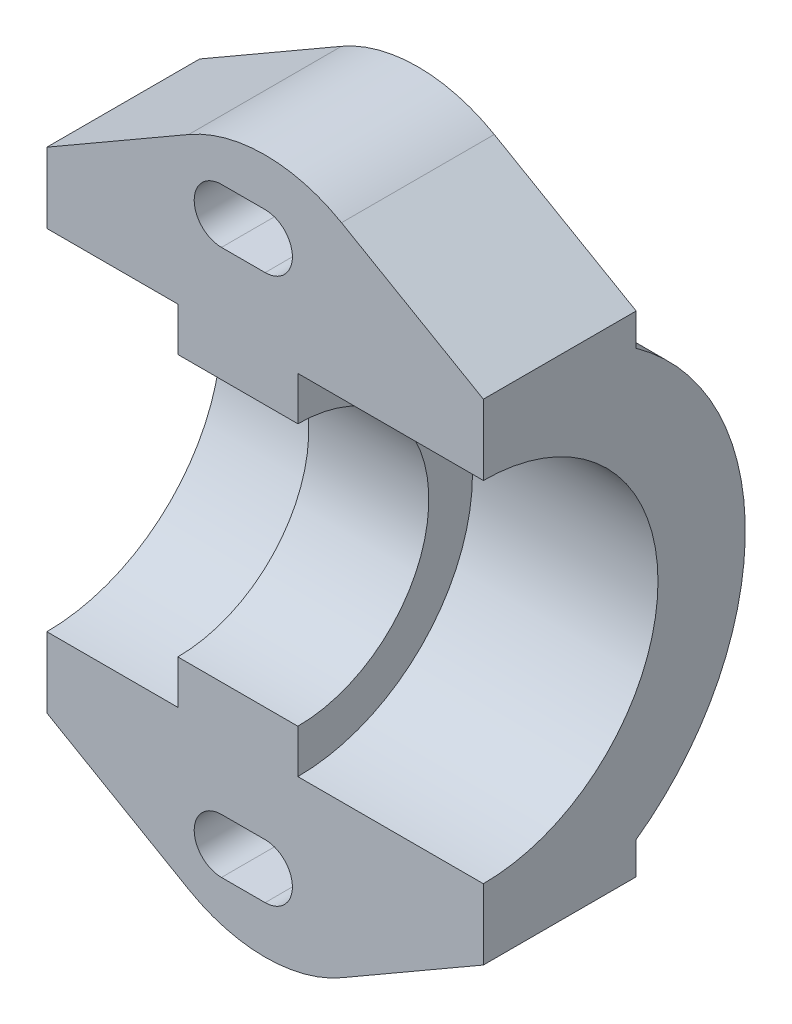
ISO-10303-21;
HEADER;
FILE_DESCRIPTION(('STEP AP214'),'2;1');
FILE_NAME('part.step','',(''),(''),'','','');
FILE_SCHEMA(('AUTOMOTIVE_DESIGN { 1 0 10303 214 1 1 1 1 }'));
ENDSEC;
DATA;
#1=APPLICATION_CONTEXT('core data for automotive mechanical design processes');
#2=APPLICATION_PROTOCOL_DEFINITION('international standard','automotive_design',2000,#1);
#3=PRODUCT_CONTEXT('',#1,'mechanical');
#4=PRODUCT('Part','Part','',(#3));
#5=PRODUCT_RELATED_PRODUCT_CATEGORY('part','',(#4));
#6=PRODUCT_DEFINITION_FORMATION('','',#4);
#7=PRODUCT_DEFINITION_CONTEXT('part definition',#1,'design');
#8=PRODUCT_DEFINITION('design','',#6,#7);
#9=PRODUCT_DEFINITION_SHAPE('','',#8);
#10=(LENGTH_UNIT() NAMED_UNIT(*) SI_UNIT(.MILLI.,.METRE.));
#11=(NAMED_UNIT(*) PLANE_ANGLE_UNIT() SI_UNIT($,.RADIAN.));
#12=(NAMED_UNIT(*) SI_UNIT($,.STERADIAN.) SOLID_ANGLE_UNIT());
#13=UNCERTAINTY_MEASURE_WITH_UNIT(LENGTH_MEASURE(1.E-05),#10,'distance_accuracy_value','');
#14=(GEOMETRIC_REPRESENTATION_CONTEXT(3) GLOBAL_UNCERTAINTY_ASSIGNED_CONTEXT((#13)) GLOBAL_UNIT_ASSIGNED_CONTEXT((#10,
#11,#12)) REPRESENTATION_CONTEXT('',''));
#15=CARTESIAN_POINT('',(0.,0.,0.));
#16=DIRECTION('',(0.,0.,1.));
#17=DIRECTION('',(1.,0.,0.));
#18=AXIS2_PLACEMENT_3D('',#15,#16,#17);
#19=CARTESIAN_POINT('',(0.,0.,0.));
#20=DIRECTION('',(-1.,0.,0.));
#21=DIRECTION('',(0.,0.,1.));
#22=AXIS2_PLACEMENT_3D('',#19,#20,#21);
#23=CYLINDRICAL_SURFACE('',#22,12.);
#24=CARTESIAN_POINT('',(20.,0.,0.));
#25=DIRECTION('',(-1.,0.,0.));
#26=DIRECTION('',(0.,0.,1.));
#27=AXIS2_PLACEMENT_3D('',#24,#25,#26);
#28=CIRCLE('',#27,12.);
#29=CARTESIAN_POINT('',(20.,9.74679434480896,-7.));
#30=VERTEX_POINT('',#29);
#31=CARTESIAN_POINT('',(20.,-9.74679434480897,-7.));
#32=VERTEX_POINT('',#31);
#33=EDGE_CURVE('E305',#30,#32,#28,.T.);
#34=ORIENTED_EDGE('',*,*,#33,.T.);
#35=DIRECTION('',(-1.,0.,0.));
#36=VECTOR('',#35,1.);
#37=CARTESIAN_POINT('',(0.,-9.74679434480897,-7.));
#38=LINE('',#37,#36);
#39=CARTESIAN_POINT('',(0.,-9.74679434480897,-7.));
#40=VERTEX_POINT('',#39);
#41=EDGE_CURVE('E254',#32,#40,#38,.T.);
#42=ORIENTED_EDGE('',*,*,#41,.T.);
#43=CARTESIAN_POINT('',(0.,0.,0.));
#44=DIRECTION('',(-1.,0.,0.));
#45=DIRECTION('',(0.,0.,1.));
#46=AXIS2_PLACEMENT_3D('',#43,#44,#45);
#47=CIRCLE('',#46,12.);
#48=CARTESIAN_POINT('',(0.,9.74679434480896,-7.));
#49=VERTEX_POINT('',#48);
#50=EDGE_CURVE('E302',#49,#40,#47,.T.);
#51=ORIENTED_EDGE('',*,*,#50,.F.);
#52=DIRECTION('',(-1.,0.,0.));
#53=VECTOR('',#52,1.);
#54=CARTESIAN_POINT('',(0.,9.74679434480897,-7.));
#55=LINE('',#54,#53);
#56=EDGE_CURVE('E321',#49,#30,#55,.F.);
#57=ORIENTED_EDGE('',*,*,#56,.T.);
#58=EDGE_LOOP('',(#34,#42,#51,#57));
#59=FACE_BOUND('',#58,.T.);
#60=ADVANCED_FACE('F35',(#59),#23,.T.);
#61=CARTESIAN_POINT('',(0.,12.,0.));
#62=DIRECTION('',(-1.,0.,0.));
#63=DIRECTION('',(0.,0.,1.));
#64=AXIS2_PLACEMENT_3D('',#61,#62,#63);
#65=PLANE('',#64);
#66=DIRECTION('',(0.,1.,0.));
#67=VECTOR('',#66,1.);
#68=CARTESIAN_POINT('',(0.,12.,0.));
#69=LINE('',#68,#67);
#70=CARTESIAN_POINT('',(0.,8.,0.));
#71=VERTEX_POINT('',#70);
#72=CARTESIAN_POINT('',(0.,11.2264973081037,0.));
#73=VERTEX_POINT('',#72);
#74=EDGE_CURVE('E282',#71,#73,#69,.T.);
#75=ORIENTED_EDGE('',*,*,#74,.T.);
#76=DIRECTION('',(0.,0.,-1.));
#77=VECTOR('',#76,1.);
#78=CARTESIAN_POINT('',(0.,11.2264973081037,0.));
#79=LINE('',#78,#77);
#80=CARTESIAN_POINT('',(0.,11.2264973081037,-7.));
#81=VERTEX_POINT('',#80);
#82=EDGE_CURVE('E361',#73,#81,#79,.T.);
#83=ORIENTED_EDGE('',*,*,#82,.T.);
#84=DIRECTION('',(0.,-1.,0.));
#85=VECTOR('',#84,1.);
#86=CARTESIAN_POINT('',(0.,8.,-7.));
#87=LINE('',#86,#85);
#88=EDGE_CURVE('E260',#81,#49,#87,.T.);
#89=ORIENTED_EDGE('',*,*,#88,.T.);
#90=ORIENTED_EDGE('',*,*,#50,.T.);
#91=DIRECTION('',(0.,-1.,0.));
#92=VECTOR('',#91,1.);
#93=CARTESIAN_POINT('',(0.,-8.,-7.));
#94=LINE('',#93,#92);
#95=CARTESIAN_POINT('',(0.,-11.2264973081037,-7.));
#96=VERTEX_POINT('',#95);
#97=EDGE_CURVE('E251',#40,#96,#94,.T.);
#98=ORIENTED_EDGE('',*,*,#97,.T.);
#99=DIRECTION('',(0.,0.,1.));
#100=VECTOR('',#99,1.);
#101=CARTESIAN_POINT('',(0.,-11.2264973081037,0.));
#102=LINE('',#101,#100);
#103=CARTESIAN_POINT('',(0.,-11.2264973081037,0.));
#104=VERTEX_POINT('',#103);
#105=EDGE_CURVE('E344',#96,#104,#102,.T.);
#106=ORIENTED_EDGE('',*,*,#105,.T.);
#107=DIRECTION('',(0.,-1.,0.));
#108=VECTOR('',#107,1.);
#109=CARTESIAN_POINT('',(0.,-12.,0.));
#110=LINE('',#109,#108);
#111=CARTESIAN_POINT('',(0.,-8.,0.));
#112=VERTEX_POINT('',#111);
#113=EDGE_CURVE('E262',#112,#104,#110,.T.);
#114=ORIENTED_EDGE('',*,*,#113,.F.);
#115=CARTESIAN_POINT('',(0.,0.,0.));
#116=DIRECTION('',(-1.,0.,0.));
#117=DIRECTION('',(0.,0.,1.));
#118=AXIS2_PLACEMENT_3D('',#115,#116,#117);
#119=CIRCLE('',#118,8.);
#120=EDGE_CURVE('E319',#71,#112,#119,.T.);
#121=ORIENTED_EDGE('',*,*,#120,.F.);
#122=EDGE_LOOP('',(#75,#83,#89,#90,#98,#106,#114,#121));
#123=FACE_BOUND('',#122,.T.);
#124=ADVANCED_FACE('F398',(#123),#65,.T.);
#125=CARTESIAN_POINT('',(0.,0.,0.));
#126=DIRECTION('',(-1.,0.,0.));
#127=DIRECTION('',(0.,0.,1.));
#128=AXIS2_PLACEMENT_3D('',#125,#126,#127);
#129=CYLINDRICAL_SURFACE('',#128,8.);
#130=CARTESIAN_POINT('',(6.,0.,0.));
#131=DIRECTION('',(-1.,0.,0.));
#132=DIRECTION('',(0.,0.,1.));
#133=AXIS2_PLACEMENT_3D('',#130,#131,#132);
#134=CIRCLE('',#133,8.);
#135=CARTESIAN_POINT('',(6.,8.,0.));
#136=VERTEX_POINT('',#135);
#137=CARTESIAN_POINT('',(6.,-8.,0.));
#138=VERTEX_POINT('',#137);
#139=EDGE_CURVE('E317',#136,#138,#134,.T.);
#140=ORIENTED_EDGE('',*,*,#139,.F.);
#141=DIRECTION('',(-1.,0.,0.));
#142=VECTOR('',#141,1.);
#143=CARTESIAN_POINT('',(0.,8.,0.));
#144=LINE('',#143,#142);
#145=EDGE_CURVE('E299',#136,#71,#144,.T.);
#146=ORIENTED_EDGE('',*,*,#145,.T.);
#147=ORIENTED_EDGE('',*,*,#120,.T.);
#148=DIRECTION('',(-1.,0.,0.));
#149=VECTOR('',#148,1.);
#150=CARTESIAN_POINT('',(0.,-8.,0.));
#151=LINE('',#150,#149);
#152=EDGE_CURVE('E279',#138,#112,#151,.T.);
#153=ORIENTED_EDGE('',*,*,#152,.F.);
#154=EDGE_LOOP('',(#140,#146,#147,#153));
#155=FACE_BOUND('',#154,.T.);
#156=ADVANCED_FACE('F446',(#155),#129,.F.);
#157=CARTESIAN_POINT('',(6.,8.,0.));
#158=DIRECTION('',(-1.,0.,0.));
#159=DIRECTION('',(0.,0.,1.));
#160=AXIS2_PLACEMENT_3D('',#157,#158,#159);
#161=PLANE('',#160);
#162=CARTESIAN_POINT('',(6.,0.,0.));
#163=DIRECTION('',(-1.,0.,0.));
#164=DIRECTION('',(0.,0.,1.));
#165=AXIS2_PLACEMENT_3D('',#162,#163,#164);
#166=CIRCLE('',#165,6.);
#167=CARTESIAN_POINT('',(6.,6.,0.));
#168=VERTEX_POINT('',#167);
#169=CARTESIAN_POINT('',(6.,-6.,0.));
#170=VERTEX_POINT('',#169);
#171=EDGE_CURVE('E315',#168,#170,#166,.T.);
#172=ORIENTED_EDGE('',*,*,#171,.F.);
#173=DIRECTION('',(0.,1.,0.));
#174=VECTOR('',#173,1.);
#175=CARTESIAN_POINT('',(6.,8.,0.));
#176=LINE('',#175,#174);
#177=EDGE_CURVE('E296',#168,#136,#176,.T.);
#178=ORIENTED_EDGE('',*,*,#177,.T.);
#179=ORIENTED_EDGE('',*,*,#139,.T.);
#180=DIRECTION('',(0.,-1.,0.));
#181=VECTOR('',#180,1.);
#182=CARTESIAN_POINT('',(6.,-8.,0.));
#183=LINE('',#182,#181);
#184=EDGE_CURVE('E276',#170,#138,#183,.T.);
#185=ORIENTED_EDGE('',*,*,#184,.F.);
#186=EDGE_LOOP('',(#172,#178,#179,#185));
#187=FACE_BOUND('',#186,.T.);
#188=ADVANCED_FACE('F443',(#187),#161,.T.);
#189=CARTESIAN_POINT('',(0.,0.,0.));
#190=DIRECTION('',(-1.,0.,0.));
#191=DIRECTION('',(0.,0.,1.));
#192=AXIS2_PLACEMENT_3D('',#189,#190,#191);
#193=CYLINDRICAL_SURFACE('',#192,6.);
#194=CARTESIAN_POINT('',(11.5,0.,0.));
#195=DIRECTION('',(-1.,0.,0.));
#196=DIRECTION('',(0.,0.,1.));
#197=AXIS2_PLACEMENT_3D('',#194,#195,#196);
#198=CIRCLE('',#197,6.);
#199=CARTESIAN_POINT('',(11.5,6.,0.));
#200=VERTEX_POINT('',#199);
#201=CARTESIAN_POINT('',(11.5,-6.,0.));
#202=VERTEX_POINT('',#201);
#203=EDGE_CURVE('E313',#200,#202,#198,.T.);
#204=ORIENTED_EDGE('',*,*,#203,.F.);
#205=DIRECTION('',(-1.,0.,0.));
#206=VECTOR('',#205,1.);
#207=CARTESIAN_POINT('',(6.,6.,0.));
#208=LINE('',#207,#206);
#209=EDGE_CURVE('E293',#200,#168,#208,.T.);
#210=ORIENTED_EDGE('',*,*,#209,.T.);
#211=ORIENTED_EDGE('',*,*,#171,.T.);
#212=DIRECTION('',(-1.,0.,0.));
#213=VECTOR('',#212,1.);
#214=CARTESIAN_POINT('',(6.,-6.,0.));
#215=LINE('',#214,#213);
#216=EDGE_CURVE('E273',#202,#170,#215,.T.);
#217=ORIENTED_EDGE('',*,*,#216,.F.);
#218=EDGE_LOOP('',(#204,#210,#211,#217));
#219=FACE_BOUND('',#218,.T.);
#220=ADVANCED_FACE('F438',(#219),#193,.F.);
#221=CARTESIAN_POINT('',(11.5,6.,0.));
#222=DIRECTION('',(1.,0.,0.));
#223=DIRECTION('',(0.,0.,-1.));
#224=AXIS2_PLACEMENT_3D('',#221,#222,#223);
#225=PLANE('',#224);
#226=CARTESIAN_POINT('',(11.5,0.,0.));
#227=DIRECTION('',(-1.,0.,0.));
#228=DIRECTION('',(0.,0.,1.));
#229=AXIS2_PLACEMENT_3D('',#226,#227,#228);
#230=CIRCLE('',#229,8.);
#231=CARTESIAN_POINT('',(11.5,8.,0.));
#232=VERTEX_POINT('',#231);
#233=CARTESIAN_POINT('',(11.5,-8.,0.));
#234=VERTEX_POINT('',#233);
#235=EDGE_CURVE('E311',#232,#234,#230,.T.);
#236=ORIENTED_EDGE('',*,*,#235,.F.);
#237=DIRECTION('',(0.,-1.,0.));
#238=VECTOR('',#237,1.);
#239=CARTESIAN_POINT('',(11.5,6.,0.));
#240=LINE('',#239,#238);
#241=EDGE_CURVE('E290',#232,#200,#240,.T.);
#242=ORIENTED_EDGE('',*,*,#241,.T.);
#243=ORIENTED_EDGE('',*,*,#203,.T.);
#244=DIRECTION('',(0.,1.,0.));
#245=VECTOR('',#244,1.);
#246=CARTESIAN_POINT('',(11.5,-6.,0.));
#247=LINE('',#246,#245);
#248=EDGE_CURVE('E270',#234,#202,#247,.T.);
#249=ORIENTED_EDGE('',*,*,#248,.F.);
#250=EDGE_LOOP('',(#236,#242,#243,#249));
#251=FACE_BOUND('',#250,.T.);
#252=ADVANCED_FACE('F434',(#251),#225,.T.);
#253=CARTESIAN_POINT('',(0.,0.,0.));
#254=DIRECTION('',(-1.,0.,0.));
#255=DIRECTION('',(0.,0.,1.));
#256=AXIS2_PLACEMENT_3D('',#253,#254,#255);
#257=CYLINDRICAL_SURFACE('',#256,8.);
#258=CARTESIAN_POINT('',(20.,0.,0.));
#259=DIRECTION('',(-1.,0.,0.));
#260=DIRECTION('',(0.,0.,1.));
#261=AXIS2_PLACEMENT_3D('',#258,#259,#260);
#262=CIRCLE('',#261,8.);
#263=CARTESIAN_POINT('',(20.,8.,0.));
#264=VERTEX_POINT('',#263);
#265=CARTESIAN_POINT('',(20.,-8.,0.));
#266=VERTEX_POINT('',#265);
#267=EDGE_CURVE('E308',#264,#266,#262,.T.);
#268=ORIENTED_EDGE('',*,*,#267,.F.);
#269=DIRECTION('',(-1.,0.,0.));
#270=VECTOR('',#269,1.);
#271=CARTESIAN_POINT('',(11.5,8.,0.));
#272=LINE('',#271,#270);
#273=EDGE_CURVE('E287',#264,#232,#272,.T.);
#274=ORIENTED_EDGE('',*,*,#273,.T.);
#275=ORIENTED_EDGE('',*,*,#235,.T.);
#276=DIRECTION('',(-1.,0.,0.));
#277=VECTOR('',#276,1.);
#278=CARTESIAN_POINT('',(11.5,-8.,0.));
#279=LINE('',#278,#277);
#280=EDGE_CURVE('E267',#266,#234,#279,.T.);
#281=ORIENTED_EDGE('',*,*,#280,.F.);
#282=EDGE_LOOP('',(#268,#274,#275,#281));
#283=FACE_BOUND('',#282,.T.);
#284=ADVANCED_FACE('F430',(#283),#257,.F.);
#285=CARTESIAN_POINT('',(20.,8.,0.));
#286=DIRECTION('',(1.,0.,0.));
#287=DIRECTION('',(0.,0.,-1.));
#288=AXIS2_PLACEMENT_3D('',#285,#286,#287);
#289=PLANE('',#288);
#290=DIRECTION('',(0.,1.,0.));
#291=VECTOR('',#290,1.);
#292=CARTESIAN_POINT('',(20.,-8.,0.));
#293=LINE('',#292,#291);
#294=CARTESIAN_POINT('',(20.,-11.2264973081037,0.));
#295=VERTEX_POINT('',#294);
#296=EDGE_CURVE('E265',#295,#266,#293,.T.);
#297=ORIENTED_EDGE('',*,*,#296,.F.);
#298=DIRECTION('',(0.,0.,-1.));
#299=VECTOR('',#298,1.);
#300=CARTESIAN_POINT('',(20.,-11.2264973081037,0.));
#301=LINE('',#300,#299);
#302=CARTESIAN_POINT('',(20.,-11.2264973081037,-7.));
#303=VERTEX_POINT('',#302);
#304=EDGE_CURVE('E367',#295,#303,#301,.T.);
#305=ORIENTED_EDGE('',*,*,#304,.T.);
#306=DIRECTION('',(0.,1.,0.));
#307=VECTOR('',#306,1.);
#308=CARTESIAN_POINT('',(20.,-12.,-7.));
#309=LINE('',#308,#307);
#310=EDGE_CURVE('E227',#303,#32,#309,.T.);
#311=ORIENTED_EDGE('',*,*,#310,.T.);
#312=ORIENTED_EDGE('',*,*,#33,.F.);
#313=DIRECTION('',(0.,1.,0.));
#314=VECTOR('',#313,1.);
#315=CARTESIAN_POINT('',(20.,8.,-7.));
#316=LINE('',#315,#314);
#317=CARTESIAN_POINT('',(20.,11.2264973081037,-7.));
#318=VERTEX_POINT('',#317);
#319=EDGE_CURVE('E257',#30,#318,#316,.T.);
#320=ORIENTED_EDGE('',*,*,#319,.T.);
#321=DIRECTION('',(0.,0.,1.));
#322=VECTOR('',#321,1.);
#323=CARTESIAN_POINT('',(20.,11.2264973081037,0.));
#324=LINE('',#323,#322);
#325=CARTESIAN_POINT('',(20.,11.2264973081037,0.));
#326=VERTEX_POINT('',#325);
#327=EDGE_CURVE('E352',#318,#326,#324,.T.);
#328=ORIENTED_EDGE('',*,*,#327,.T.);
#329=DIRECTION('',(0.,-1.,0.));
#330=VECTOR('',#329,1.);
#331=CARTESIAN_POINT('',(20.,8.,0.));
#332=LINE('',#331,#330);
#333=EDGE_CURVE('E285',#326,#264,#332,.T.);
#334=ORIENTED_EDGE('',*,*,#333,.T.);
#335=ORIENTED_EDGE('',*,*,#267,.T.);
#336=EDGE_LOOP('',(#297,#305,#311,#312,#320,#328,#334,#335));
#337=FACE_BOUND('',#336,.T.);
#338=ADVANCED_FACE('F424',(#337),#289,.T.);
#339=CARTESIAN_POINT('',(0.,0.,0.));
#340=DIRECTION('',(0.,0.,1.));
#341=DIRECTION('',(-1.,0.,0.));
#342=AXIS2_PLACEMENT_3D('',#339,#340,#341);
#343=PLANE('',#342);
#344=CARTESIAN_POINT('',(8.,12.5,0.));
#345=DIRECTION('',(0.,0.,1.));
#346=DIRECTION('',(1.,0.,0.));
#347=AXIS2_PLACEMENT_3D('',#344,#345,#346);
#348=CIRCLE('',#347,1.25);
#349=CARTESIAN_POINT('',(8.,13.75,0.));
#350=VERTEX_POINT('',#349);
#351=CARTESIAN_POINT('',(8.,11.25,0.));
#352=VERTEX_POINT('',#351);
#353=EDGE_CURVE('E215',#350,#352,#348,.T.);
#354=ORIENTED_EDGE('',*,*,#353,.F.);
#355=DIRECTION('',(-1.,0.,0.));
#356=VECTOR('',#355,1.);
#357=CARTESIAN_POINT('',(8.,13.75,0.));
#358=LINE('',#357,#356);
#359=CARTESIAN_POINT('',(10.,13.75,0.));
#360=VERTEX_POINT('',#359);
#361=EDGE_CURVE('E220',#360,#350,#358,.T.);
#362=ORIENTED_EDGE('',*,*,#361,.F.);
#363=CARTESIAN_POINT('',(10.,12.5,0.));
#364=DIRECTION('',(0.,0.,1.));
#365=DIRECTION('',(1.,0.,0.));
#366=AXIS2_PLACEMENT_3D('',#363,#364,#365);
#367=CIRCLE('',#366,1.25);
#368=CARTESIAN_POINT('',(10.,11.25,0.));
#369=VERTEX_POINT('',#368);
#370=EDGE_CURVE('E199',#369,#360,#367,.T.);
#371=ORIENTED_EDGE('',*,*,#370,.F.);
#372=DIRECTION('',(1.,0.,0.));
#373=VECTOR('',#372,1.);
#374=CARTESIAN_POINT('',(8.,11.25,0.));
#375=LINE('',#374,#373);
#376=EDGE_CURVE('E210',#352,#369,#375,.T.);
#377=ORIENTED_EDGE('',*,*,#376,.F.);
#378=EDGE_LOOP('',(#354,#362,#371,#377));
#379=FACE_BOUND('',#378,.T.);
#380=DIRECTION('',(0.86602540378444,-0.499999999999998,0.));
#381=VECTOR('',#380,1.);
#382=CARTESIAN_POINT('',(9.86121593216768,17.0801270189222,1.19269889503274E-13));
#383=LINE('',#382,#381);
#384=CARTESIAN_POINT('',(13.5,14.9792740578363,1.04599711684705E-13));
#385=VERTEX_POINT('',#384);
#386=EDGE_CURVE('E355',#326,#385,#383,.F.);
#387=ORIENTED_EDGE('',*,*,#386,.T.);
#388=CARTESIAN_POINT('',(9.99999999999999,8.91709623134522,0.));
#389=DIRECTION('',(0.,0.,1.));
#390=DIRECTION('',(0.,-1.,0.));
#391=AXIS2_PLACEMENT_3D('',#388,#389,#390);
#392=CIRCLE('',#391,7.);
#393=CARTESIAN_POINT('',(6.50000000000001,14.9792740578363,1.04599711684705E-13));
#394=VERTEX_POINT('',#393);
#395=EDGE_CURVE('E11',#385,#394,#392,.T.);
#396=ORIENTED_EDGE('',*,*,#395,.T.);
#397=DIRECTION('',(0.86602540378444,0.499999999999998,0.));
#398=VECTOR('',#397,1.);
#399=CARTESIAN_POINT('',(-4.86121593216772,8.41987298107783,0.));
#400=LINE('',#399,#398);
#401=EDGE_CURVE('E359',#394,#73,#400,.F.);
#402=ORIENTED_EDGE('',*,*,#401,.T.);
#403=ORIENTED_EDGE('',*,*,#74,.F.);
#404=ORIENTED_EDGE('',*,*,#145,.F.);
#405=ORIENTED_EDGE('',*,*,#177,.F.);
#406=ORIENTED_EDGE('',*,*,#209,.F.);
#407=ORIENTED_EDGE('',*,*,#241,.F.);
#408=ORIENTED_EDGE('',*,*,#273,.F.);
#409=ORIENTED_EDGE('',*,*,#333,.F.);
#410=EDGE_LOOP('',(#387,#396,#402,#403,#404,#405,#406,#407,#408,#409));
#411=FACE_BOUND('',#410,.T.);
#412=ADVANCED_FACE('F217',(#379,#411),#343,.T.);
#413=CARTESIAN_POINT('',(0.,0.,0.));
#414=DIRECTION('',(0.,0.,-1.));
#415=DIRECTION('',(-1.,0.,0.));
#416=AXIS2_PLACEMENT_3D('',#413,#414,#415);
#417=PLANE('',#416);
#418=DIRECTION('',(1.,0.,0.));
#419=VECTOR('',#418,1.);
#420=CARTESIAN_POINT('',(8.,-13.75,0.));
#421=LINE('',#420,#419);
#422=CARTESIAN_POINT('',(8.,-13.75,0.));
#423=VERTEX_POINT('',#422);
#424=CARTESIAN_POINT('',(10.,-13.75,0.));
#425=VERTEX_POINT('',#424);
#426=EDGE_CURVE('E232',#423,#425,#421,.T.);
#427=ORIENTED_EDGE('',*,*,#426,.F.);
#428=CARTESIAN_POINT('',(8.,-12.5,0.));
#429=DIRECTION('',(0.,0.,1.));
#430=DIRECTION('',(1.,0.,0.));
#431=AXIS2_PLACEMENT_3D('',#428,#429,#430);
#432=CIRCLE('',#431,1.25);
#433=CARTESIAN_POINT('',(8.,-11.25,0.));
#434=VERTEX_POINT('',#433);
#435=EDGE_CURVE('E230',#434,#423,#432,.T.);
#436=ORIENTED_EDGE('',*,*,#435,.F.);
#437=DIRECTION('',(-1.,0.,0.));
#438=VECTOR('',#437,1.);
#439=CARTESIAN_POINT('',(8.,-11.25,0.));
#440=LINE('',#439,#438);
#441=CARTESIAN_POINT('',(10.,-11.25,0.));
#442=VERTEX_POINT('',#441);
#443=EDGE_CURVE('E238',#442,#434,#440,.T.);
#444=ORIENTED_EDGE('',*,*,#443,.F.);
#445=CARTESIAN_POINT('',(10.,-12.5,0.));
#446=DIRECTION('',(0.,0.,1.));
#447=DIRECTION('',(1.,0.,0.));
#448=AXIS2_PLACEMENT_3D('',#445,#446,#447);
#449=CIRCLE('',#448,1.25);
#450=EDGE_CURVE('E235',#425,#442,#449,.T.);
#451=ORIENTED_EDGE('',*,*,#450,.F.);
#452=EDGE_LOOP('',(#427,#436,#444,#451));
#453=FACE_BOUND('',#452,.T.);
#454=DIRECTION('',(-0.86602540378444,0.499999999999998,0.));
#455=VECTOR('',#454,1.);
#456=CARTESIAN_POINT('',(0.,-11.2264973081037,0.));
#457=LINE('',#456,#455);
#458=CARTESIAN_POINT('',(6.50000000000003,-14.9792740578363,0.));
#459=VERTEX_POINT('',#458);
#460=EDGE_CURVE('E347',#104,#459,#457,.F.);
#461=ORIENTED_EDGE('',*,*,#460,.T.);
#462=CARTESIAN_POINT('',(10.,-8.91709623134522,0.));
#463=DIRECTION('',(0.,0.,-1.));
#464=DIRECTION('',(-1.,0.,0.));
#465=AXIS2_PLACEMENT_3D('',#462,#463,#464);
#466=CIRCLE('',#465,7.);
#467=CARTESIAN_POINT('',(13.5,-14.9792740578363,0.));
#468=VERTEX_POINT('',#467);
#469=EDGE_CURVE('E379',#459,#468,#466,.F.);
#470=ORIENTED_EDGE('',*,*,#469,.T.);
#471=DIRECTION('',(-0.86602540378444,-0.499999999999998,0.));
#472=VECTOR('',#471,1.);
#473=CARTESIAN_POINT('',(9.99999999999995,-17.,0.));
#474=LINE('',#473,#472);
#475=EDGE_CURVE('E365',#468,#295,#474,.F.);
#476=ORIENTED_EDGE('',*,*,#475,.T.);
#477=ORIENTED_EDGE('',*,*,#296,.T.);
#478=ORIENTED_EDGE('',*,*,#280,.T.);
#479=ORIENTED_EDGE('',*,*,#248,.T.);
#480=ORIENTED_EDGE('',*,*,#216,.T.);
#481=ORIENTED_EDGE('',*,*,#184,.T.);
#482=ORIENTED_EDGE('',*,*,#152,.T.);
#483=ORIENTED_EDGE('',*,*,#113,.T.);
#484=EDGE_LOOP('',(#461,#470,#476,#477,#478,#479,#480,#481,#482,#483));
#485=FACE_BOUND('',#484,.T.);
#486=ADVANCED_FACE('F414',(#453,#485),#417,.F.);
#487=CARTESIAN_POINT('',(0.,0.,-7.));
#488=DIRECTION('',(0.,0.,1.));
#489=DIRECTION('',(1.,0.,0.));
#490=AXIS2_PLACEMENT_3D('',#487,#488,#489);
#491=PLANE('',#490);
#492=DIRECTION('',(-1.,0.,0.));
#493=VECTOR('',#492,1.);
#494=CARTESIAN_POINT('',(0.,13.75,-7.));
#495=LINE('',#494,#493);
#496=CARTESIAN_POINT('',(10.,13.75,-7.));
#497=VERTEX_POINT('',#496);
#498=CARTESIAN_POINT('',(8.,13.75,-7.));
#499=VERTEX_POINT('',#498);
#500=EDGE_CURVE('E338',#497,#499,#495,.T.);
#501=ORIENTED_EDGE('',*,*,#500,.T.);
#502=CARTESIAN_POINT('',(8.,12.5,-7.));
#503=DIRECTION('',(0.,0.,1.));
#504=DIRECTION('',(1.,0.,0.));
#505=AXIS2_PLACEMENT_3D('',#502,#503,#504);
#506=CIRCLE('',#505,1.25);
#507=CARTESIAN_POINT('',(8.,11.25,-7.));
#508=VERTEX_POINT('',#507);
#509=EDGE_CURVE('E341',#499,#508,#506,.T.);
#510=ORIENTED_EDGE('',*,*,#509,.T.);
#511=DIRECTION('',(1.,0.,0.));
#512=VECTOR('',#511,1.);
#513=CARTESIAN_POINT('',(0.,11.25,-7.));
#514=LINE('',#513,#512);
#515=CARTESIAN_POINT('',(10.,11.25,-7.));
#516=VERTEX_POINT('',#515);
#517=EDGE_CURVE('E335',#508,#516,#514,.T.);
#518=ORIENTED_EDGE('',*,*,#517,.T.);
#519=CARTESIAN_POINT('',(10.,12.5,-7.));
#520=DIRECTION('',(0.,0.,1.));
#521=DIRECTION('',(1.,0.,0.));
#522=AXIS2_PLACEMENT_3D('',#519,#520,#521);
#523=CIRCLE('',#522,1.25);
#524=EDGE_CURVE('E202',#516,#497,#523,.T.);
#525=ORIENTED_EDGE('',*,*,#524,.T.);
#526=EDGE_LOOP('',(#501,#510,#518,#525));
#527=FACE_BOUND('',#526,.T.);
#528=DIRECTION('',(-0.86602540378444,-0.499999999999998,0.));
#529=VECTOR('',#528,1.);
#530=CARTESIAN_POINT('',(10.,17.,-7.));
#531=LINE('',#530,#529);
#532=CARTESIAN_POINT('',(6.50000000000001,14.9792740578363,-7.));
#533=VERTEX_POINT('',#532);
#534=EDGE_CURVE('E363',#81,#533,#531,.F.);
#535=ORIENTED_EDGE('',*,*,#534,.T.);
#536=CARTESIAN_POINT('',(9.99999999999999,8.91709623134522,-7.));
#537=DIRECTION('',(0.,0.,1.));
#538=DIRECTION('',(1.,0.,0.));
#539=AXIS2_PLACEMENT_3D('',#536,#537,#538);
#540=CIRCLE('',#539,7.);
#541=CARTESIAN_POINT('',(13.5,14.9792740578363,-7.));
#542=VERTEX_POINT('',#541);
#543=EDGE_CURVE('E57',#533,#542,#540,.F.);
#544=ORIENTED_EDGE('',*,*,#543,.T.);
#545=DIRECTION('',(-0.86602540378444,0.499999999999998,0.));
#546=VECTOR('',#545,1.);
#547=CARTESIAN_POINT('',(20.,11.2264973081037,-7.));
#548=LINE('',#547,#546);
#549=EDGE_CURVE('E357',#542,#318,#548,.F.);
#550=ORIENTED_EDGE('',*,*,#549,.T.);
#551=ORIENTED_EDGE('',*,*,#319,.F.);
#552=ORIENTED_EDGE('',*,*,#56,.F.);
#553=ORIENTED_EDGE('',*,*,#88,.F.);
#554=EDGE_LOOP('',(#535,#544,#550,#551,#552,#553));
#555=FACE_BOUND('',#554,.T.);
#556=ADVANCED_FACE('F393',(#527,#555),#491,.F.);
#557=CARTESIAN_POINT('',(0.,0.,-7.));
#558=DIRECTION('',(0.,0.,1.));
#559=DIRECTION('',(1.,0.,0.));
#560=AXIS2_PLACEMENT_3D('',#557,#558,#559);
#561=PLANE('',#560);
#562=DIRECTION('',(-1.,0.,0.));
#563=VECTOR('',#562,1.);
#564=CARTESIAN_POINT('',(0.,-11.25,-7.));
#565=LINE('',#564,#563);
#566=CARTESIAN_POINT('',(10.,-11.25,-7.));
#567=VERTEX_POINT('',#566);
#568=CARTESIAN_POINT('',(8.,-11.25,-7.));
#569=VERTEX_POINT('',#568);
#570=EDGE_CURVE('E329',#567,#569,#565,.T.);
#571=ORIENTED_EDGE('',*,*,#570,.T.);
#572=CARTESIAN_POINT('',(8.,-12.5,-7.));
#573=DIRECTION('',(0.,0.,1.));
#574=DIRECTION('',(1.,0.,0.));
#575=AXIS2_PLACEMENT_3D('',#572,#573,#574);
#576=CIRCLE('',#575,1.25);
#577=CARTESIAN_POINT('',(8.,-13.75,-7.));
#578=VERTEX_POINT('',#577);
#579=EDGE_CURVE('E332',#569,#578,#576,.T.);
#580=ORIENTED_EDGE('',*,*,#579,.T.);
#581=DIRECTION('',(1.,0.,0.));
#582=VECTOR('',#581,1.);
#583=CARTESIAN_POINT('',(0.,-13.75,-7.));
#584=LINE('',#583,#582);
#585=CARTESIAN_POINT('',(10.,-13.75,-7.));
#586=VERTEX_POINT('',#585);
#587=EDGE_CURVE('E323',#578,#586,#584,.T.);
#588=ORIENTED_EDGE('',*,*,#587,.T.);
#589=CARTESIAN_POINT('',(10.,-12.5,-7.));
#590=DIRECTION('',(0.,0.,1.));
#591=DIRECTION('',(1.,0.,0.));
#592=AXIS2_PLACEMENT_3D('',#589,#590,#591);
#593=CIRCLE('',#592,1.25);
#594=EDGE_CURVE('E326',#586,#567,#593,.T.);
#595=ORIENTED_EDGE('',*,*,#594,.T.);
#596=EDGE_LOOP('',(#571,#580,#588,#595));
#597=FACE_BOUND('',#596,.T.);
#598=DIRECTION('',(0.86602540378444,0.499999999999998,0.));
#599=VECTOR('',#598,1.);
#600=CARTESIAN_POINT('',(9.99999999999995,-17.,-7.));
#601=LINE('',#600,#599);
#602=CARTESIAN_POINT('',(13.5,-14.9792740578363,-7.));
#603=VERTEX_POINT('',#602);
#604=EDGE_CURVE('E369',#303,#603,#601,.F.);
#605=ORIENTED_EDGE('',*,*,#604,.T.);
#606=CARTESIAN_POINT('',(10.,-8.91709623134522,-7.));
#607=DIRECTION('',(0.,0.,1.));
#608=DIRECTION('',(1.,0.,0.));
#609=AXIS2_PLACEMENT_3D('',#606,#607,#608);
#610=CIRCLE('',#609,7.);
#611=CARTESIAN_POINT('',(6.50000000000003,-14.9792740578363,-7.));
#612=VERTEX_POINT('',#611);
#613=EDGE_CURVE('E375',#603,#612,#610,.F.);
#614=ORIENTED_EDGE('',*,*,#613,.T.);
#615=DIRECTION('',(0.86602540378444,-0.499999999999998,0.));
#616=VECTOR('',#615,1.);
#617=CARTESIAN_POINT('',(0.,-11.2264973081037,-7.));
#618=LINE('',#617,#616);
#619=EDGE_CURVE('E350',#612,#96,#618,.F.);
#620=ORIENTED_EDGE('',*,*,#619,.T.);
#621=ORIENTED_EDGE('',*,*,#97,.F.);
#622=ORIENTED_EDGE('',*,*,#41,.F.);
#623=ORIENTED_EDGE('',*,*,#310,.F.);
#624=EDGE_LOOP('',(#605,#614,#620,#621,#622,#623));
#625=FACE_BOUND('',#624,.T.);
#626=ADVANCED_FACE('F404',(#597,#625),#561,.F.);
#627=CARTESIAN_POINT('',(8.,-12.5,-12.));
#628=DIRECTION('',(0.,0.,1.));
#629=DIRECTION('',(1.,0.,0.));
#630=AXIS2_PLACEMENT_3D('',#627,#628,#629);
#631=CYLINDRICAL_SURFACE('',#630,1.25);
#632=DIRECTION('',(0.,0.,1.));
#633=VECTOR('',#632,1.);
#634=CARTESIAN_POINT('',(8.,-11.25,-12.));
#635=LINE('',#634,#633);
#636=EDGE_CURVE('E242',#569,#434,#635,.T.);
#637=ORIENTED_EDGE('',*,*,#636,.T.);
#638=ORIENTED_EDGE('',*,*,#435,.T.);
#639=DIRECTION('',(0.,0.,1.));
#640=VECTOR('',#639,1.);
#641=CARTESIAN_POINT('',(8.,-13.75,-12.));
#642=LINE('',#641,#640);
#643=EDGE_CURVE('E241',#578,#423,#642,.T.);
#644=ORIENTED_EDGE('',*,*,#643,.F.);
#645=ORIENTED_EDGE('',*,*,#579,.F.);
#646=EDGE_LOOP('',(#637,#638,#644,#645));
#647=FACE_BOUND('',#646,.T.);
#648=ADVANCED_FACE('F583',(#647),#631,.F.);
#649=CARTESIAN_POINT('',(8.,-11.25,-12.));
#650=DIRECTION('',(0.,1.,0.));
#651=DIRECTION('',(-1.,0.,0.));
#652=AXIS2_PLACEMENT_3D('',#649,#650,#651);
#653=PLANE('',#652);
#654=DIRECTION('',(0.,0.,1.));
#655=VECTOR('',#654,1.);
#656=CARTESIAN_POINT('',(10.,-11.25,-12.));
#657=LINE('',#656,#655);
#658=EDGE_CURVE('E244',#567,#442,#657,.T.);
#659=ORIENTED_EDGE('',*,*,#658,.T.);
#660=ORIENTED_EDGE('',*,*,#443,.T.);
#661=ORIENTED_EDGE('',*,*,#636,.F.);
#662=ORIENTED_EDGE('',*,*,#570,.F.);
#663=EDGE_LOOP('',(#659,#660,#661,#662));
#664=FACE_BOUND('',#663,.T.);
#665=ADVANCED_FACE('F574',(#664),#653,.F.);
#666=CARTESIAN_POINT('',(10.,-12.5,-12.));
#667=DIRECTION('',(0.,0.,1.));
#668=DIRECTION('',(1.,0.,0.));
#669=AXIS2_PLACEMENT_3D('',#666,#667,#668);
#670=CYLINDRICAL_SURFACE('',#669,1.25);
#671=DIRECTION('',(0.,0.,1.));
#672=VECTOR('',#671,1.);
#673=CARTESIAN_POINT('',(10.,-13.75,-12.));
#674=LINE('',#673,#672);
#675=EDGE_CURVE('E246',#586,#425,#674,.T.);
#676=ORIENTED_EDGE('',*,*,#675,.T.);
#677=ORIENTED_EDGE('',*,*,#450,.T.);
#678=ORIENTED_EDGE('',*,*,#658,.F.);
#679=ORIENTED_EDGE('',*,*,#594,.F.);
#680=EDGE_LOOP('',(#676,#677,#678,#679));
#681=FACE_BOUND('',#680,.T.);
#682=ADVANCED_FACE('F565',(#681),#670,.F.);
#683=CARTESIAN_POINT('',(8.,-13.75,-12.));
#684=DIRECTION('',(0.,-1.,0.));
#685=DIRECTION('',(1.,0.,0.));
#686=AXIS2_PLACEMENT_3D('',#683,#684,#685);
#687=PLANE('',#686);
#688=ORIENTED_EDGE('',*,*,#643,.T.);
#689=ORIENTED_EDGE('',*,*,#426,.T.);
#690=ORIENTED_EDGE('',*,*,#675,.F.);
#691=ORIENTED_EDGE('',*,*,#587,.F.);
#692=EDGE_LOOP('',(#688,#689,#690,#691));
#693=FACE_BOUND('',#692,.T.);
#694=ADVANCED_FACE('F556',(#693),#687,.F.);
#695=CARTESIAN_POINT('',(8.,12.5,-12.));
#696=DIRECTION('',(0.,0.,1.));
#697=DIRECTION('',(1.,0.,0.));
#698=AXIS2_PLACEMENT_3D('',#695,#696,#697);
#699=CYLINDRICAL_SURFACE('',#698,1.25);
#700=DIRECTION('',(0.,0.,1.));
#701=VECTOR('',#700,1.);
#702=CARTESIAN_POINT('',(8.,13.75,-12.));
#703=LINE('',#702,#701);
#704=EDGE_CURVE('E225',#499,#350,#703,.T.);
#705=ORIENTED_EDGE('',*,*,#704,.T.);
#706=ORIENTED_EDGE('',*,*,#353,.T.);
#707=DIRECTION('',(0.,0.,1.));
#708=VECTOR('',#707,1.);
#709=CARTESIAN_POINT('',(8.,11.25,-12.));
#710=LINE('',#709,#708);
#711=EDGE_CURVE('E206',#508,#352,#710,.T.);
#712=ORIENTED_EDGE('',*,*,#711,.F.);
#713=ORIENTED_EDGE('',*,*,#509,.F.);
#714=EDGE_LOOP('',(#705,#706,#712,#713));
#715=FACE_BOUND('',#714,.T.);
#716=ADVANCED_FACE('F547',(#715),#699,.F.);
#717=CARTESIAN_POINT('',(8.,13.75,-12.));
#718=DIRECTION('',(0.,1.,0.));
#719=DIRECTION('',(-1.,0.,0.));
#720=AXIS2_PLACEMENT_3D('',#717,#718,#719);
#721=PLANE('',#720);
#722=DIRECTION('',(0.,0.,1.));
#723=VECTOR('',#722,1.);
#724=CARTESIAN_POINT('',(10.,13.75,-12.));
#725=LINE('',#724,#723);
#726=EDGE_CURVE('E205',#497,#360,#725,.T.);
#727=ORIENTED_EDGE('',*,*,#726,.T.);
#728=ORIENTED_EDGE('',*,*,#361,.T.);
#729=ORIENTED_EDGE('',*,*,#704,.F.);
#730=ORIENTED_EDGE('',*,*,#500,.F.);
#731=EDGE_LOOP('',(#727,#728,#729,#730));
#732=FACE_BOUND('',#731,.T.);
#733=ADVANCED_FACE('F539',(#732),#721,.F.);
#734=CARTESIAN_POINT('',(10.,12.5,-12.));
#735=DIRECTION('',(0.,0.,1.));
#736=DIRECTION('',(1.,0.,0.));
#737=AXIS2_PLACEMENT_3D('',#734,#735,#736);
#738=CYLINDRICAL_SURFACE('',#737,1.25);
#739=DIRECTION('',(0.,0.,1.));
#740=VECTOR('',#739,1.);
#741=CARTESIAN_POINT('',(10.,11.25,-12.));
#742=LINE('',#741,#740);
#743=EDGE_CURVE('E194',#516,#369,#742,.T.);
#744=ORIENTED_EDGE('',*,*,#743,.T.);
#745=ORIENTED_EDGE('',*,*,#370,.T.);
#746=ORIENTED_EDGE('',*,*,#726,.F.);
#747=ORIENTED_EDGE('',*,*,#524,.F.);
#748=EDGE_LOOP('',(#744,#745,#746,#747));
#749=FACE_BOUND('',#748,.T.);
#750=ADVANCED_FACE('F196',(#749),#738,.F.);
#751=CARTESIAN_POINT('',(8.,11.25,-12.));
#752=DIRECTION('',(0.,-1.,0.));
#753=DIRECTION('',(1.,0.,0.));
#754=AXIS2_PLACEMENT_3D('',#751,#752,#753);
#755=PLANE('',#754);
#756=ORIENTED_EDGE('',*,*,#711,.T.);
#757=ORIENTED_EDGE('',*,*,#376,.T.);
#758=ORIENTED_EDGE('',*,*,#743,.F.);
#759=ORIENTED_EDGE('',*,*,#517,.F.);
#760=EDGE_LOOP('',(#756,#757,#758,#759));
#761=FACE_BOUND('',#760,.T.);
#762=ADVANCED_FACE('F211',(#761),#755,.F.);
#763=CARTESIAN_POINT('',(0.,-11.2264973081037,0.));
#764=DIRECTION('',(0.499999999999998,0.86602540378444,0.));
#765=DIRECTION('',(0.,0.,1.));
#766=AXIS2_PLACEMENT_3D('',#763,#764,#765);
#767=PLANE('',#766);
#768=ORIENTED_EDGE('',*,*,#619,.F.);
#769=DIRECTION('',(0.,0.,1.));
#770=VECTOR('',#769,1.);
#771=CARTESIAN_POINT('',(6.50000000000003,-14.9792740578363,0.));
#772=LINE('',#771,#770);
#773=EDGE_CURVE('E377',#612,#459,#772,.T.);
#774=ORIENTED_EDGE('',*,*,#773,.T.);
#775=ORIENTED_EDGE('',*,*,#460,.F.);
#776=ORIENTED_EDGE('',*,*,#105,.F.);
#777=EDGE_LOOP('',(#768,#774,#775,#776));
#778=FACE_BOUND('',#777,.T.);
#779=ADVANCED_FACE('F410',(#778),#767,.F.);
#780=CARTESIAN_POINT('',(20.,11.2264973081037,0.));
#781=DIRECTION('',(-0.499999999999998,-0.86602540378444,0.));
#782=DIRECTION('',(0.,0.,1.));
#783=AXIS2_PLACEMENT_3D('',#780,#781,#782);
#784=PLANE('',#783);
#785=ORIENTED_EDGE('',*,*,#549,.F.);
#786=DIRECTION('',(0.,0.,1.));
#787=VECTOR('',#786,1.);
#788=CARTESIAN_POINT('',(13.5,14.9792740578363,0.));
#789=LINE('',#788,#787);
#790=EDGE_CURVE('E43',#542,#385,#789,.T.);
#791=ORIENTED_EDGE('',*,*,#790,.T.);
#792=ORIENTED_EDGE('',*,*,#386,.F.);
#793=ORIENTED_EDGE('',*,*,#327,.F.);
#794=EDGE_LOOP('',(#785,#791,#792,#793));
#795=FACE_BOUND('',#794,.T.);
#796=ADVANCED_FACE('F479',(#795),#784,.F.);
#797=CARTESIAN_POINT('',(10.,17.,-7.));
#798=DIRECTION('',(0.499999999999998,-0.86602540378444,0.));
#799=DIRECTION('',(0.,0.,1.));
#800=AXIS2_PLACEMENT_3D('',#797,#798,#799);
#801=PLANE('',#800);
#802=ORIENTED_EDGE('',*,*,#401,.F.);
#803=DIRECTION('',(0.,0.,1.));
#804=VECTOR('',#803,1.);
#805=CARTESIAN_POINT('',(6.50000000000001,14.9792740578363,-7.));
#806=LINE('',#805,#804);
#807=EDGE_CURVE('E381',#394,#533,#806,.F.);
#808=ORIENTED_EDGE('',*,*,#807,.T.);
#809=ORIENTED_EDGE('',*,*,#534,.F.);
#810=ORIENTED_EDGE('',*,*,#82,.F.);
#811=EDGE_LOOP('',(#802,#808,#809,#810));
#812=FACE_BOUND('',#811,.T.);
#813=ADVANCED_FACE('F388',(#812),#801,.F.);
#814=CARTESIAN_POINT('',(9.99999999999995,-17.,-7.));
#815=DIRECTION('',(-0.499999999999998,0.86602540378444,0.));
#816=DIRECTION('',(0.,0.,1.));
#817=AXIS2_PLACEMENT_3D('',#814,#815,#816);
#818=PLANE('',#817);
#819=ORIENTED_EDGE('',*,*,#475,.F.);
#820=DIRECTION('',(0.,0.,1.));
#821=VECTOR('',#820,1.);
#822=CARTESIAN_POINT('',(13.5,-14.9792740578363,-7.));
#823=LINE('',#822,#821);
#824=EDGE_CURVE('E372',#468,#603,#823,.F.);
#825=ORIENTED_EDGE('',*,*,#824,.T.);
#826=ORIENTED_EDGE('',*,*,#604,.F.);
#827=ORIENTED_EDGE('',*,*,#304,.F.);
#828=EDGE_LOOP('',(#819,#825,#826,#827));
#829=FACE_BOUND('',#828,.T.);
#830=ADVANCED_FACE('F420',(#829),#818,.F.);
#831=CARTESIAN_POINT('',(10.,-8.91709623134522,-7.));
#832=DIRECTION('',(0.,0.,-1.));
#833=DIRECTION('',(-1.,0.,0.));
#834=AXIS2_PLACEMENT_3D('',#831,#832,#833);
#835=CYLINDRICAL_SURFACE('',#834,7.);
#836=ORIENTED_EDGE('',*,*,#469,.F.);
#837=ORIENTED_EDGE('',*,*,#773,.F.);
#838=ORIENTED_EDGE('',*,*,#613,.F.);
#839=ORIENTED_EDGE('',*,*,#824,.F.);
#840=EDGE_LOOP('',(#836,#837,#838,#839));
#841=FACE_BOUND('',#840,.T.);
#842=ADVANCED_FACE('F418',(#841),#835,.T.);
#843=CARTESIAN_POINT('',(9.99999999999999,8.91709623134522,-7.));
#844=DIRECTION('',(0.,0.,-1.));
#845=DIRECTION('',(-1.,0.,0.));
#846=AXIS2_PLACEMENT_3D('',#843,#844,#845);
#847=CYLINDRICAL_SURFACE('',#846,7.);
#848=ORIENTED_EDGE('',*,*,#395,.F.);
#849=ORIENTED_EDGE('',*,*,#790,.F.);
#850=ORIENTED_EDGE('',*,*,#543,.F.);
#851=ORIENTED_EDGE('',*,*,#807,.F.);
#852=EDGE_LOOP('',(#848,#849,#850,#851));
#853=FACE_BOUND('',#852,.T.);
#854=ADVANCED_FACE('F37',(#853),#847,.T.);
#855=CLOSED_SHELL('',(#60,#124,#156,#188,#220,#252,#284,#338,#412,#486,#556,#626,#648,#665,#682,
#694,#716,#733,#750,#762,#779,#796,#813,#830,#842,#854));
#856=MANIFOLD_SOLID_BREP('B2',#855);
#857=ADVANCED_BREP_SHAPE_REPRESENTATION('',(#18,#856),#14);
#858=SHAPE_DEFINITION_REPRESENTATION(#9,#857);
ENDSEC;
END-ISO-10303-21;
